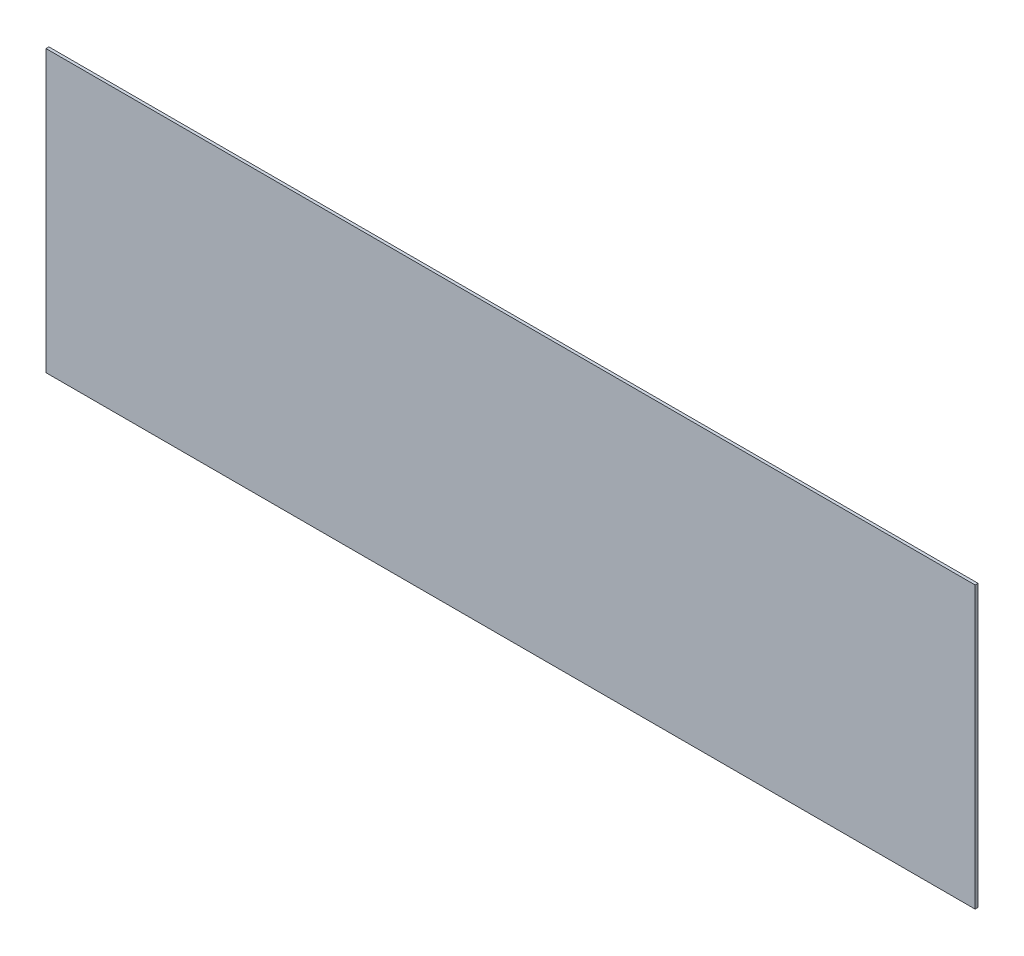
ISO-10303-21;
HEADER;
FILE_DESCRIPTION(('STEP AP214'),'2;1');
FILE_NAME('part.step','',(''),(''),'','','');
FILE_SCHEMA(('AUTOMOTIVE_DESIGN { 1 0 10303 214 1 1 1 1 }'));
ENDSEC;
DATA;
#1=APPLICATION_CONTEXT('core data for automotive mechanical design processes');
#2=APPLICATION_PROTOCOL_DEFINITION('international standard','automotive_design',2000,#1);
#3=PRODUCT_CONTEXT('',#1,'mechanical');
#4=PRODUCT('Part','Part','',(#3));
#5=PRODUCT_RELATED_PRODUCT_CATEGORY('part','',(#4));
#6=PRODUCT_DEFINITION_FORMATION('','',#4);
#7=PRODUCT_DEFINITION_CONTEXT('part definition',#1,'design');
#8=PRODUCT_DEFINITION('design','',#6,#7);
#9=PRODUCT_DEFINITION_SHAPE('','',#8);
#10=(LENGTH_UNIT() NAMED_UNIT(*) SI_UNIT(.MILLI.,.METRE.));
#11=(NAMED_UNIT(*) PLANE_ANGLE_UNIT() SI_UNIT($,.RADIAN.));
#12=(NAMED_UNIT(*) SI_UNIT($,.STERADIAN.) SOLID_ANGLE_UNIT());
#13=UNCERTAINTY_MEASURE_WITH_UNIT(LENGTH_MEASURE(1.E-05),#10,'distance_accuracy_value','');
#14=(GEOMETRIC_REPRESENTATION_CONTEXT(3) GLOBAL_UNCERTAINTY_ASSIGNED_CONTEXT((#13)) GLOBAL_UNIT_ASSIGNED_CONTEXT((#10,
#11,#12)) REPRESENTATION_CONTEXT('',''));
#15=CARTESIAN_POINT('',(0.,0.,0.));
#16=DIRECTION('',(0.,0.,1.));
#17=DIRECTION('',(1.,0.,0.));
#18=AXIS2_PLACEMENT_3D('',#15,#16,#17);
#19=CARTESIAN_POINT('',(28.55,0.3,0.05));
#20=DIRECTION('',(-1.,0.,0.));
#21=DIRECTION('',(0.,0.,1.));
#22=AXIS2_PLACEMENT_3D('',#19,#20,#21);
#23=PLANE('',#22);
#24=DIRECTION('',(0.,0.,-1.));
#25=VECTOR('',#24,1.);
#26=CARTESIAN_POINT('',(28.55,-4.55,0.05));
#27=LINE('',#26,#25);
#28=CARTESIAN_POINT('',(28.55,-4.55,0.1));
#29=VERTEX_POINT('',#28);
#30=CARTESIAN_POINT('',(28.55,-4.55,0.));
#31=VERTEX_POINT('',#30);
#32=EDGE_CURVE('E74',#29,#31,#27,.T.);
#33=ORIENTED_EDGE('',*,*,#32,.T.);
#34=DIRECTION('',(0.,-1.,0.));
#35=VECTOR('',#34,1.);
#36=CARTESIAN_POINT('',(28.55,0.3,0.));
#37=LINE('',#36,#35);
#38=CARTESIAN_POINT('',(28.55,5.15,0.));
#39=VERTEX_POINT('',#38);
#40=EDGE_CURVE('E90',#39,#31,#37,.T.);
#41=ORIENTED_EDGE('',*,*,#40,.F.);
#42=DIRECTION('',(0.,0.,-1.));
#43=VECTOR('',#42,1.);
#44=CARTESIAN_POINT('',(28.55,5.15,0.05));
#45=LINE('',#44,#43);
#46=CARTESIAN_POINT('',(28.55,5.15,0.1));
#47=VERTEX_POINT('',#46);
#48=EDGE_CURVE('E11',#47,#39,#45,.T.);
#49=ORIENTED_EDGE('',*,*,#48,.F.);
#50=DIRECTION('',(0.,1.,0.));
#51=VECTOR('',#50,1.);
#52=CARTESIAN_POINT('',(28.55,0.3,0.1));
#53=LINE('',#52,#51);
#54=EDGE_CURVE('E88',#29,#47,#53,.T.);
#55=ORIENTED_EDGE('',*,*,#54,.F.);
#56=EDGE_LOOP('',(#33,#41,#49,#55));
#57=FACE_BOUND('',#56,.T.);
#58=ADVANCED_FACE('F16',(#57),#23,.F.);
#59=CARTESIAN_POINT('',(12.5,5.15,0.05));
#60=DIRECTION('',(0.,-1.,0.));
#61=DIRECTION('',(0.,0.,-1.));
#62=AXIS2_PLACEMENT_3D('',#59,#60,#61);
#63=PLANE('',#62);
#64=ORIENTED_EDGE('',*,*,#48,.T.);
#65=DIRECTION('',(1.,0.,0.));
#66=VECTOR('',#65,1.);
#67=CARTESIAN_POINT('',(12.5,5.15,0.));
#68=LINE('',#67,#66);
#69=CARTESIAN_POINT('',(-3.55,5.15,0.));
#70=VERTEX_POINT('',#69);
#71=EDGE_CURVE('E105',#70,#39,#68,.T.);
#72=ORIENTED_EDGE('',*,*,#71,.F.);
#73=DIRECTION('',(0.,0.,-1.));
#74=VECTOR('',#73,1.);
#75=CARTESIAN_POINT('',(-3.55,5.15,0.05));
#76=LINE('',#75,#74);
#77=CARTESIAN_POINT('',(-3.55,5.15,0.1));
#78=VERTEX_POINT('',#77);
#79=EDGE_CURVE('E26',#78,#70,#76,.T.);
#80=ORIENTED_EDGE('',*,*,#79,.F.);
#81=DIRECTION('',(-1.,0.,0.));
#82=VECTOR('',#81,1.);
#83=CARTESIAN_POINT('',(12.5,5.15,0.1));
#84=LINE('',#83,#82);
#85=EDGE_CURVE('E93',#47,#78,#84,.T.);
#86=ORIENTED_EDGE('',*,*,#85,.F.);
#87=EDGE_LOOP('',(#64,#72,#80,#86));
#88=FACE_BOUND('',#87,.T.);
#89=ADVANCED_FACE('F123',(#88),#63,.F.);
#90=CARTESIAN_POINT('',(-3.55,0.3,0.05));
#91=DIRECTION('',(1.,0.,0.));
#92=DIRECTION('',(0.,1.,0.));
#93=AXIS2_PLACEMENT_3D('',#90,#91,#92);
#94=PLANE('',#93);
#95=ORIENTED_EDGE('',*,*,#79,.T.);
#96=DIRECTION('',(0.,1.,0.));
#97=VECTOR('',#96,1.);
#98=CARTESIAN_POINT('',(-3.55,0.3,0.));
#99=LINE('',#98,#97);
#100=CARTESIAN_POINT('',(-3.55,-4.55,0.));
#101=VERTEX_POINT('',#100);
#102=EDGE_CURVE('E101',#101,#70,#99,.T.);
#103=ORIENTED_EDGE('',*,*,#102,.F.);
#104=DIRECTION('',(0.,0.,-1.));
#105=VECTOR('',#104,1.);
#106=CARTESIAN_POINT('',(-3.55,-4.55,0.05));
#107=LINE('',#106,#105);
#108=CARTESIAN_POINT('',(-3.55,-4.55,0.1));
#109=VERTEX_POINT('',#108);
#110=EDGE_CURVE('E51',#109,#101,#107,.T.);
#111=ORIENTED_EDGE('',*,*,#110,.F.);
#112=DIRECTION('',(0.,-1.,0.));
#113=VECTOR('',#112,1.);
#114=CARTESIAN_POINT('',(-3.55,0.3,0.1));
#115=LINE('',#114,#113);
#116=EDGE_CURVE('E20',#78,#109,#115,.T.);
#117=ORIENTED_EDGE('',*,*,#116,.F.);
#118=EDGE_LOOP('',(#95,#103,#111,#117));
#119=FACE_BOUND('',#118,.T.);
#120=ADVANCED_FACE('F124',(#119),#94,.F.);
#121=CARTESIAN_POINT('',(12.5,-4.55,0.05));
#122=DIRECTION('',(0.,1.,0.));
#123=DIRECTION('',(1.,0.,0.));
#124=AXIS2_PLACEMENT_3D('',#121,#122,#123);
#125=PLANE('',#124);
#126=ORIENTED_EDGE('',*,*,#110,.T.);
#127=DIRECTION('',(-1.,0.,0.));
#128=VECTOR('',#127,1.);
#129=CARTESIAN_POINT('',(12.5,-4.55,0.));
#130=LINE('',#129,#128);
#131=EDGE_CURVE('E80',#31,#101,#130,.T.);
#132=ORIENTED_EDGE('',*,*,#131,.F.);
#133=ORIENTED_EDGE('',*,*,#32,.F.);
#134=DIRECTION('',(1.,0.,0.));
#135=VECTOR('',#134,1.);
#136=CARTESIAN_POINT('',(12.5,-4.55,0.1));
#137=LINE('',#136,#135);
#138=EDGE_CURVE('E77',#109,#29,#137,.T.);
#139=ORIENTED_EDGE('',*,*,#138,.F.);
#140=EDGE_LOOP('',(#126,#132,#133,#139));
#141=FACE_BOUND('',#140,.T.);
#142=ADVANCED_FACE('F76',(#141),#125,.F.);
#143=CARTESIAN_POINT('',(12.5,0.3,0.));
#144=DIRECTION('',(0.,0.,1.));
#145=DIRECTION('',(1.,0.,0.));
#146=AXIS2_PLACEMENT_3D('',#143,#144,#145);
#147=PLANE('',#146);
#148=ORIENTED_EDGE('',*,*,#40,.T.);
#149=ORIENTED_EDGE('',*,*,#131,.T.);
#150=ORIENTED_EDGE('',*,*,#102,.T.);
#151=ORIENTED_EDGE('',*,*,#71,.T.);
#152=EDGE_LOOP('',(#148,#149,#150,#151));
#153=FACE_BOUND('',#152,.T.);
#154=ADVANCED_FACE('F18',(#153),#147,.F.);
#155=CARTESIAN_POINT('',(12.5,0.3,0.1));
#156=DIRECTION('',(0.,0.,1.));
#157=DIRECTION('',(1.,0.,0.));
#158=AXIS2_PLACEMENT_3D('',#155,#156,#157);
#159=PLANE('',#158);
#160=ORIENTED_EDGE('',*,*,#54,.T.);
#161=ORIENTED_EDGE('',*,*,#85,.T.);
#162=ORIENTED_EDGE('',*,*,#116,.T.);
#163=ORIENTED_EDGE('',*,*,#138,.T.);
#164=EDGE_LOOP('',(#160,#161,#162,#163));
#165=FACE_BOUND('',#164,.T.);
#166=ADVANCED_FACE('F86',(#165),#159,.T.);
#167=CLOSED_SHELL('',(#58,#89,#120,#142,#154,#166));
#168=MANIFOLD_SOLID_BREP('B1',#167);
#169=ADVANCED_BREP_SHAPE_REPRESENTATION('',(#18,#168),#14);
#170=SHAPE_DEFINITION_REPRESENTATION(#9,#169);
ENDSEC;
END-ISO-10303-21;
